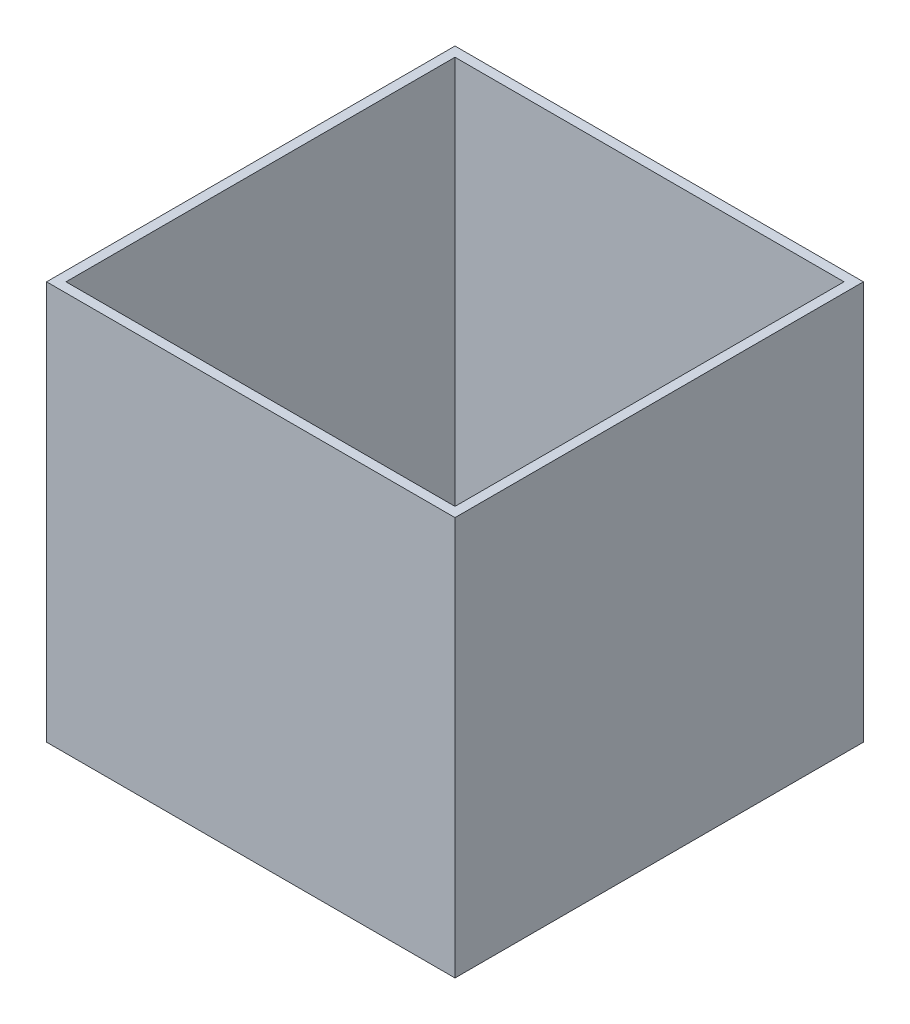
ISO-10303-21;
HEADER;
FILE_DESCRIPTION(('STEP AP214'),'2;1');
FILE_NAME('part.step','',(''),(''),'','','');
FILE_SCHEMA(('AUTOMOTIVE_DESIGN { 1 0 10303 214 1 1 1 1 }'));
ENDSEC;
DATA;
#1=APPLICATION_CONTEXT('core data for automotive mechanical design processes');
#2=APPLICATION_PROTOCOL_DEFINITION('international standard','automotive_design',2000,#1);
#3=PRODUCT_CONTEXT('',#1,'mechanical');
#4=PRODUCT('Part','Part','',(#3));
#5=PRODUCT_RELATED_PRODUCT_CATEGORY('part','',(#4));
#6=PRODUCT_DEFINITION_FORMATION('','',#4);
#7=PRODUCT_DEFINITION_CONTEXT('part definition',#1,'design');
#8=PRODUCT_DEFINITION('design','',#6,#7);
#9=PRODUCT_DEFINITION_SHAPE('','',#8);
#10=(LENGTH_UNIT() NAMED_UNIT(*) SI_UNIT(.MILLI.,.METRE.));
#11=(NAMED_UNIT(*) PLANE_ANGLE_UNIT() SI_UNIT($,.RADIAN.));
#12=(NAMED_UNIT(*) SI_UNIT($,.STERADIAN.) SOLID_ANGLE_UNIT());
#13=UNCERTAINTY_MEASURE_WITH_UNIT(LENGTH_MEASURE(1.E-05),#10,'distance_accuracy_value','');
#14=(GEOMETRIC_REPRESENTATION_CONTEXT(3) GLOBAL_UNCERTAINTY_ASSIGNED_CONTEXT((#13)) GLOBAL_UNIT_ASSIGNED_CONTEXT((#10,
#11,#12)) REPRESENTATION_CONTEXT('',''));
#15=CARTESIAN_POINT('',(0.,0.,0.));
#16=DIRECTION('',(0.,0.,1.));
#17=DIRECTION('',(1.,0.,0.));
#18=AXIS2_PLACEMENT_3D('',#15,#16,#17);
#19=CARTESIAN_POINT('',(0.,10.,0.));
#20=DIRECTION('',(1.,0.,0.));
#21=DIRECTION('',(0.,0.,-1.));
#22=AXIS2_PLACEMENT_3D('',#19,#20,#21);
#23=PLANE('',#22);
#24=DIRECTION('',(0.,0.,1.));
#25=VECTOR('',#24,1.);
#26=CARTESIAN_POINT('',(0.,0.,0.));
#27=LINE('',#26,#25);
#28=CARTESIAN_POINT('',(0.,0.,-420.));
#29=VERTEX_POINT('',#28);
#30=CARTESIAN_POINT('',(0.,0.,0.));
#31=VERTEX_POINT('',#30);
#32=EDGE_CURVE('E150',#29,#31,#27,.T.);
#33=ORIENTED_EDGE('',*,*,#32,.T.);
#34=DIRECTION('',(0.,-1.,0.));
#35=VECTOR('',#34,1.);
#36=CARTESIAN_POINT('',(0.,10.,0.));
#37=LINE('',#36,#35);
#38=CARTESIAN_POINT('',(0.,410.,0.));
#39=VERTEX_POINT('',#38);
#40=EDGE_CURVE('E11',#39,#31,#37,.T.);
#41=ORIENTED_EDGE('',*,*,#40,.F.);
#42=DIRECTION('',(0.,0.,1.));
#43=VECTOR('',#42,1.);
#44=CARTESIAN_POINT('',(0.,410.,-420.));
#45=LINE('',#44,#43);
#46=CARTESIAN_POINT('',(0.,410.,-420.));
#47=VERTEX_POINT('',#46);
#48=EDGE_CURVE('E115',#47,#39,#45,.T.);
#49=ORIENTED_EDGE('',*,*,#48,.F.);
#50=DIRECTION('',(0.,-1.,0.));
#51=VECTOR('',#50,1.);
#52=CARTESIAN_POINT('',(0.,10.,-420.));
#53=LINE('',#52,#51);
#54=EDGE_CURVE('E158',#47,#29,#53,.T.);
#55=ORIENTED_EDGE('',*,*,#54,.T.);
#56=EDGE_LOOP('',(#33,#41,#49,#55));
#57=FACE_BOUND('',#56,.T.);
#58=ADVANCED_FACE('F33',(#57),#23,.F.);
#59=CARTESIAN_POINT('',(0.,10.,0.));
#60=DIRECTION('',(0.,0.,-1.));
#61=DIRECTION('',(-1.,0.,0.));
#62=AXIS2_PLACEMENT_3D('',#59,#60,#61);
#63=PLANE('',#62);
#64=DIRECTION('',(1.,0.,0.));
#65=VECTOR('',#64,1.);
#66=CARTESIAN_POINT('',(0.,0.,0.));
#67=LINE('',#66,#65);
#68=CARTESIAN_POINT('',(420.,0.,0.));
#69=VERTEX_POINT('',#68);
#70=EDGE_CURVE('E153',#31,#69,#67,.T.);
#71=ORIENTED_EDGE('',*,*,#70,.T.);
#72=DIRECTION('',(0.,-1.,0.));
#73=VECTOR('',#72,1.);
#74=CARTESIAN_POINT('',(420.,10.,0.));
#75=LINE('',#74,#73);
#76=CARTESIAN_POINT('',(420.,410.,0.));
#77=VERTEX_POINT('',#76);
#78=EDGE_CURVE('E40',#77,#69,#75,.T.);
#79=ORIENTED_EDGE('',*,*,#78,.F.);
#80=DIRECTION('',(1.,0.,0.));
#81=VECTOR('',#80,1.);
#82=CARTESIAN_POINT('',(0.,410.,0.));
#83=LINE('',#82,#81);
#84=EDGE_CURVE('E141',#39,#77,#83,.T.);
#85=ORIENTED_EDGE('',*,*,#84,.F.);
#86=ORIENTED_EDGE('',*,*,#40,.T.);
#87=EDGE_LOOP('',(#71,#79,#85,#86));
#88=FACE_BOUND('',#87,.T.);
#89=ADVANCED_FACE('F176',(#88),#63,.F.);
#90=CARTESIAN_POINT('',(420.,10.,0.));
#91=DIRECTION('',(-1.,0.,0.));
#92=DIRECTION('',(0.,0.,1.));
#93=AXIS2_PLACEMENT_3D('',#90,#91,#92);
#94=PLANE('',#93);
#95=DIRECTION('',(0.,0.,-1.));
#96=VECTOR('',#95,1.);
#97=CARTESIAN_POINT('',(420.,0.,0.));
#98=LINE('',#97,#96);
#99=CARTESIAN_POINT('',(420.,0.,-420.));
#100=VERTEX_POINT('',#99);
#101=EDGE_CURVE('E155',#69,#100,#98,.T.);
#102=ORIENTED_EDGE('',*,*,#101,.T.);
#103=DIRECTION('',(0.,-1.,0.));
#104=VECTOR('',#103,1.);
#105=CARTESIAN_POINT('',(420.,10.,-420.));
#106=LINE('',#105,#104);
#107=CARTESIAN_POINT('',(420.,410.,-420.));
#108=VERTEX_POINT('',#107);
#109=EDGE_CURVE('E160',#108,#100,#106,.T.);
#110=ORIENTED_EDGE('',*,*,#109,.F.);
#111=DIRECTION('',(0.,0.,-1.));
#112=VECTOR('',#111,1.);
#113=CARTESIAN_POINT('',(420.,410.,-420.));
#114=LINE('',#113,#112);
#115=EDGE_CURVE('E144',#77,#108,#114,.T.);
#116=ORIENTED_EDGE('',*,*,#115,.F.);
#117=ORIENTED_EDGE('',*,*,#78,.T.);
#118=EDGE_LOOP('',(#102,#110,#116,#117));
#119=FACE_BOUND('',#118,.T.);
#120=ADVANCED_FACE('F165',(#119),#94,.F.);
#121=CARTESIAN_POINT('',(0.,10.,-420.));
#122=DIRECTION('',(0.,0.,1.));
#123=DIRECTION('',(1.,0.,0.));
#124=AXIS2_PLACEMENT_3D('',#121,#122,#123);
#125=PLANE('',#124);
#126=DIRECTION('',(-1.,0.,0.));
#127=VECTOR('',#126,1.);
#128=CARTESIAN_POINT('',(0.,0.,-420.));
#129=LINE('',#128,#127);
#130=EDGE_CURVE('E55',#100,#29,#129,.T.);
#131=ORIENTED_EDGE('',*,*,#130,.T.);
#132=ORIENTED_EDGE('',*,*,#54,.F.);
#133=DIRECTION('',(-1.,0.,0.));
#134=VECTOR('',#133,1.);
#135=CARTESIAN_POINT('',(0.,410.,-420.));
#136=LINE('',#135,#134);
#137=EDGE_CURVE('E147',#108,#47,#136,.T.);
#138=ORIENTED_EDGE('',*,*,#137,.F.);
#139=ORIENTED_EDGE('',*,*,#109,.T.);
#140=EDGE_LOOP('',(#131,#132,#138,#139));
#141=FACE_BOUND('',#140,.T.);
#142=ADVANCED_FACE('F174',(#141),#125,.F.);
#143=CARTESIAN_POINT('',(0.,0.,0.));
#144=DIRECTION('',(0.,-1.,0.));
#145=DIRECTION('',(0.,0.,-1.));
#146=AXIS2_PLACEMENT_3D('',#143,#144,#145);
#147=PLANE('',#146);
#148=ORIENTED_EDGE('',*,*,#32,.F.);
#149=ORIENTED_EDGE('',*,*,#130,.F.);
#150=ORIENTED_EDGE('',*,*,#101,.F.);
#151=ORIENTED_EDGE('',*,*,#70,.F.);
#152=EDGE_LOOP('',(#148,#149,#150,#151));
#153=FACE_BOUND('',#152,.T.);
#154=ADVANCED_FACE('F170',(#153),#147,.T.);
#155=CARTESIAN_POINT('',(0.,410.,0.));
#156=DIRECTION('',(0.,1.,0.));
#157=DIRECTION('',(0.,0.,1.));
#158=AXIS2_PLACEMENT_3D('',#155,#156,#157);
#159=PLANE('',#158);
#160=ORIENTED_EDGE('',*,*,#48,.T.);
#161=ORIENTED_EDGE('',*,*,#84,.T.);
#162=ORIENTED_EDGE('',*,*,#115,.T.);
#163=ORIENTED_EDGE('',*,*,#137,.T.);
#164=EDGE_LOOP('',(#160,#161,#162,#163));
#165=FACE_BOUND('',#164,.T.);
#166=DIRECTION('',(1.,0.,0.));
#167=VECTOR('',#166,1.);
#168=CARTESIAN_POINT('',(10.,410.,-9.99999999999995));
#169=LINE('',#168,#167);
#170=CARTESIAN_POINT('',(10.,410.,-9.99999999999995));
#171=VERTEX_POINT('',#170);
#172=CARTESIAN_POINT('',(410.,410.,-9.99999999999995));
#173=VERTEX_POINT('',#172);
#174=EDGE_CURVE('E107',#171,#173,#169,.T.);
#175=ORIENTED_EDGE('',*,*,#174,.F.);
#176=DIRECTION('',(0.,0.,1.));
#177=VECTOR('',#176,1.);
#178=CARTESIAN_POINT('',(10.,410.,-410.));
#179=LINE('',#178,#177);
#180=CARTESIAN_POINT('',(10.,410.,-410.));
#181=VERTEX_POINT('',#180);
#182=EDGE_CURVE('E99',#181,#171,#179,.T.);
#183=ORIENTED_EDGE('',*,*,#182,.F.);
#184=DIRECTION('',(-1.,0.,0.));
#185=VECTOR('',#184,1.);
#186=CARTESIAN_POINT('',(10.,410.,-410.));
#187=LINE('',#186,#185);
#188=CARTESIAN_POINT('',(410.,410.,-410.));
#189=VERTEX_POINT('',#188);
#190=EDGE_CURVE('E123',#189,#181,#187,.T.);
#191=ORIENTED_EDGE('',*,*,#190,.F.);
#192=DIRECTION('',(0.,0.,-1.));
#193=VECTOR('',#192,1.);
#194=CARTESIAN_POINT('',(410.,410.,-410.));
#195=LINE('',#194,#193);
#196=EDGE_CURVE('E121',#173,#189,#195,.T.);
#197=ORIENTED_EDGE('',*,*,#196,.F.);
#198=EDGE_LOOP('',(#175,#183,#191,#197));
#199=FACE_BOUND('',#198,.T.);
#200=ADVANCED_FACE('F119',(#165,#199),#159,.T.);
#201=CARTESIAN_POINT('',(10.,410.,-410.));
#202=DIRECTION('',(1.,0.,0.));
#203=DIRECTION('',(0.,0.,-1.));
#204=AXIS2_PLACEMENT_3D('',#201,#202,#203);
#205=PLANE('',#204);
#206=DIRECTION('',(0.,0.,1.));
#207=VECTOR('',#206,1.);
#208=CARTESIAN_POINT('',(10.,10.,-410.));
#209=LINE('',#208,#207);
#210=CARTESIAN_POINT('',(10.,10.,-410.));
#211=VERTEX_POINT('',#210);
#212=CARTESIAN_POINT('',(10.,10.,-9.99999999999995));
#213=VERTEX_POINT('',#212);
#214=EDGE_CURVE('E127',#211,#213,#209,.T.);
#215=ORIENTED_EDGE('',*,*,#214,.F.);
#216=DIRECTION('',(0.,-1.,0.));
#217=VECTOR('',#216,1.);
#218=CARTESIAN_POINT('',(10.,410.,-410.));
#219=LINE('',#218,#217);
#220=EDGE_CURVE('E47',#181,#211,#219,.T.);
#221=ORIENTED_EDGE('',*,*,#220,.F.);
#222=ORIENTED_EDGE('',*,*,#182,.T.);
#223=DIRECTION('',(0.,-1.,0.));
#224=VECTOR('',#223,1.);
#225=CARTESIAN_POINT('',(10.,410.,-9.99999999999995));
#226=LINE('',#225,#224);
#227=EDGE_CURVE('E102',#171,#213,#226,.T.);
#228=ORIENTED_EDGE('',*,*,#227,.T.);
#229=EDGE_LOOP('',(#215,#221,#222,#228));
#230=FACE_BOUND('',#229,.T.);
#231=ADVANCED_FACE('F101',(#230),#205,.T.);
#232=CARTESIAN_POINT('',(10.,410.,-9.99999999999995));
#233=DIRECTION('',(0.,0.,-1.));
#234=DIRECTION('',(-1.,0.,0.));
#235=AXIS2_PLACEMENT_3D('',#232,#233,#234);
#236=PLANE('',#235);
#237=DIRECTION('',(1.,0.,0.));
#238=VECTOR('',#237,1.);
#239=CARTESIAN_POINT('',(10.,10.,-9.99999999999995));
#240=LINE('',#239,#238);
#241=CARTESIAN_POINT('',(410.,10.,-9.99999999999995));
#242=VERTEX_POINT('',#241);
#243=EDGE_CURVE('E114',#213,#242,#240,.T.);
#244=ORIENTED_EDGE('',*,*,#243,.F.);
#245=ORIENTED_EDGE('',*,*,#227,.F.);
#246=ORIENTED_EDGE('',*,*,#174,.T.);
#247=DIRECTION('',(0.,-1.,0.));
#248=VECTOR('',#247,1.);
#249=CARTESIAN_POINT('',(410.,410.,-9.99999999999995));
#250=LINE('',#249,#248);
#251=EDGE_CURVE('E116',#173,#242,#250,.T.);
#252=ORIENTED_EDGE('',*,*,#251,.T.);
#253=EDGE_LOOP('',(#244,#245,#246,#252));
#254=FACE_BOUND('',#253,.T.);
#255=ADVANCED_FACE('F111',(#254),#236,.T.);
#256=CARTESIAN_POINT('',(410.,410.,-410.));
#257=DIRECTION('',(-1.,0.,0.));
#258=DIRECTION('',(0.,0.,1.));
#259=AXIS2_PLACEMENT_3D('',#256,#257,#258);
#260=PLANE('',#259);
#261=DIRECTION('',(0.,0.,-1.));
#262=VECTOR('',#261,1.);
#263=CARTESIAN_POINT('',(410.,10.,-410.));
#264=LINE('',#263,#262);
#265=CARTESIAN_POINT('',(410.,10.,-410.));
#266=VERTEX_POINT('',#265);
#267=EDGE_CURVE('E130',#242,#266,#264,.T.);
#268=ORIENTED_EDGE('',*,*,#267,.F.);
#269=ORIENTED_EDGE('',*,*,#251,.F.);
#270=ORIENTED_EDGE('',*,*,#196,.T.);
#271=DIRECTION('',(0.,-1.,0.));
#272=VECTOR('',#271,1.);
#273=CARTESIAN_POINT('',(410.,410.,-410.));
#274=LINE('',#273,#272);
#275=EDGE_CURVE('E136',#189,#266,#274,.T.);
#276=ORIENTED_EDGE('',*,*,#275,.T.);
#277=EDGE_LOOP('',(#268,#269,#270,#276));
#278=FACE_BOUND('',#277,.T.);
#279=ADVANCED_FACE('F199',(#278),#260,.T.);
#280=CARTESIAN_POINT('',(10.,410.,-410.));
#281=DIRECTION('',(0.,0.,1.));
#282=DIRECTION('',(1.,0.,0.));
#283=AXIS2_PLACEMENT_3D('',#280,#281,#282);
#284=PLANE('',#283);
#285=DIRECTION('',(-1.,0.,0.));
#286=VECTOR('',#285,1.);
#287=CARTESIAN_POINT('',(10.,10.,-410.));
#288=LINE('',#287,#286);
#289=EDGE_CURVE('E108',#266,#211,#288,.T.);
#290=ORIENTED_EDGE('',*,*,#289,.F.);
#291=ORIENTED_EDGE('',*,*,#275,.F.);
#292=ORIENTED_EDGE('',*,*,#190,.T.);
#293=ORIENTED_EDGE('',*,*,#220,.T.);
#294=EDGE_LOOP('',(#290,#291,#292,#293));
#295=FACE_BOUND('',#294,.T.);
#296=ADVANCED_FACE('F191',(#295),#284,.T.);
#297=CARTESIAN_POINT('',(0.,10.,0.));
#298=DIRECTION('',(0.,-1.,0.));
#299=DIRECTION('',(0.,0.,-1.));
#300=AXIS2_PLACEMENT_3D('',#297,#298,#299);
#301=PLANE('',#300);
#302=ORIENTED_EDGE('',*,*,#289,.T.);
#303=ORIENTED_EDGE('',*,*,#214,.T.);
#304=ORIENTED_EDGE('',*,*,#243,.T.);
#305=ORIENTED_EDGE('',*,*,#267,.T.);
#306=EDGE_LOOP('',(#302,#303,#304,#305));
#307=FACE_BOUND('',#306,.T.);
#308=ADVANCED_FACE('F188',(#307),#301,.F.);
#309=CLOSED_SHELL('',(#58,#89,#120,#142,#154,#200,#231,#255,#279,#296,#308));
#310=MANIFOLD_SOLID_BREP('B2',#309);
#311=ADVANCED_BREP_SHAPE_REPRESENTATION('',(#18,#310),#14);
#312=SHAPE_DEFINITION_REPRESENTATION(#9,#311);
ENDSEC;
END-ISO-10303-21;
